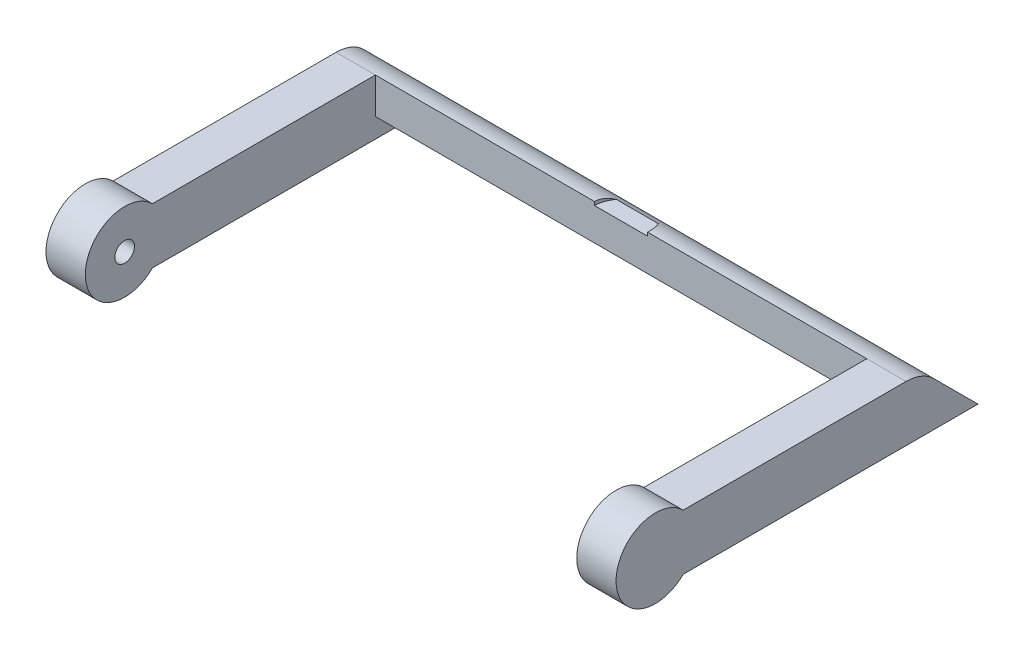
ISO-10303-21;
HEADER;
FILE_DESCRIPTION(('STEP AP214'),'2;1');
FILE_NAME('part.step','',(''),(''),'','','');
FILE_SCHEMA(('AUTOMOTIVE_DESIGN { 1 0 10303 214 1 1 1 1 }'));
ENDSEC;
DATA;
#1=APPLICATION_CONTEXT('core data for automotive mechanical design processes');
#2=APPLICATION_PROTOCOL_DEFINITION('international standard','automotive_design',2000,#1);
#3=PRODUCT_CONTEXT('',#1,'mechanical');
#4=PRODUCT('Part','Part','',(#3));
#5=PRODUCT_RELATED_PRODUCT_CATEGORY('part','',(#4));
#6=PRODUCT_DEFINITION_FORMATION('','',#4);
#7=PRODUCT_DEFINITION_CONTEXT('part definition',#1,'design');
#8=PRODUCT_DEFINITION('design','',#6,#7);
#9=PRODUCT_DEFINITION_SHAPE('','',#8);
#10=(LENGTH_UNIT() NAMED_UNIT(*) SI_UNIT(.MILLI.,.METRE.));
#11=(NAMED_UNIT(*) PLANE_ANGLE_UNIT() SI_UNIT($,.RADIAN.));
#12=(NAMED_UNIT(*) SI_UNIT($,.STERADIAN.) SOLID_ANGLE_UNIT());
#13=UNCERTAINTY_MEASURE_WITH_UNIT(LENGTH_MEASURE(1.E-05),#10,'distance_accuracy_value','');
#14=(GEOMETRIC_REPRESENTATION_CONTEXT(3) GLOBAL_UNCERTAINTY_ASSIGNED_CONTEXT((#13)) GLOBAL_UNIT_ASSIGNED_CONTEXT((#10,
#11,#12)) REPRESENTATION_CONTEXT('',''));
#15=CARTESIAN_POINT('',(0.,0.,0.));
#16=DIRECTION('',(0.,0.,1.));
#17=DIRECTION('',(1.,0.,0.));
#18=AXIS2_PLACEMENT_3D('',#15,#16,#17);
#19=CARTESIAN_POINT('',(29.,1.41421356237309,1.4142135623731));
#20=DIRECTION('',(-1.,0.,0.));
#21=DIRECTION('',(0.,0.,1.));
#22=AXIS2_PLACEMENT_3D('',#19,#20,#21);
#23=CYLINDRICAL_SURFACE('',#22,2.);
#24=DIRECTION('',(-1.,0.,0.));
#25=VECTOR('',#24,1.);
#26=CARTESIAN_POINT('',(29.,0.,0.));
#27=LINE('',#26,#25);
#28=CARTESIAN_POINT('',(2.,0.,0.));
#29=VERTEX_POINT('',#28);
#30=CARTESIAN_POINT('',(0.,0.,0.));
#31=VERTEX_POINT('',#30);
#32=EDGE_CURVE('E261',#29,#31,#27,.T.);
#33=ORIENTED_EDGE('',*,*,#32,.F.);
#34=CARTESIAN_POINT('',(2.,1.41421356237309,1.4142135623731));
#35=DIRECTION('',(-1.,0.,0.));
#36=DIRECTION('',(0.,0.,1.));
#37=AXIS2_PLACEMENT_3D('',#34,#35,#36);
#38=CIRCLE('',#37,2.);
#39=CARTESIAN_POINT('',(2.,2.82842712474618,0.));
#40=VERTEX_POINT('',#39);
#41=EDGE_CURVE('E287',#29,#40,#38,.T.);
#42=ORIENTED_EDGE('',*,*,#41,.T.);
#43=DIRECTION('',(-1.,0.,0.));
#44=VECTOR('',#43,1.);
#45=CARTESIAN_POINT('',(29.,2.82842712474618,0.));
#46=LINE('',#45,#44);
#47=CARTESIAN_POINT('',(0.,2.82842712474618,0.));
#48=VERTEX_POINT('',#47);
#49=EDGE_CURVE('E245',#40,#48,#46,.T.);
#50=ORIENTED_EDGE('',*,*,#49,.T.);
#51=CARTESIAN_POINT('',(0.,1.41421356237309,1.4142135623731));
#52=DIRECTION('',(1.,0.,0.));
#53=DIRECTION('',(0.,0.,-1.));
#54=AXIS2_PLACEMENT_3D('',#51,#52,#53);
#55=CIRCLE('',#54,2.);
#56=EDGE_CURVE('E294',#48,#31,#55,.T.);
#57=ORIENTED_EDGE('',*,*,#56,.T.);
#58=EDGE_LOOP('',(#33,#42,#50,#57));
#59=FACE_BOUND('',#58,.T.);
#60=ADVANCED_FACE('F32',(#59),#23,.T.);
#61=CARTESIAN_POINT('',(29.,2.82842712474617,-11.3431457505076));
#62=DIRECTION('',(0.,-1.,0.));
#63=DIRECTION('',(0.,0.,-1.));
#64=AXIS2_PLACEMENT_3D('',#61,#62,#63);
#65=PLANE('',#64);
#66=ORIENTED_EDGE('',*,*,#49,.F.);
#67=DIRECTION('',(0.,0.,-1.));
#68=VECTOR('',#67,1.);
#69=CARTESIAN_POINT('',(2.,2.82842712474617,-11.3431457505076));
#70=LINE('',#69,#68);
#71=CARTESIAN_POINT('',(2.,2.82842712474616,-11.3431457505076));
#72=VERTEX_POINT('',#71);
#73=EDGE_CURVE('E266',#40,#72,#70,.T.);
#74=ORIENTED_EDGE('',*,*,#73,.T.);
#75=DIRECTION('',(-1.,0.,0.));
#76=VECTOR('',#75,1.);
#77=CARTESIAN_POINT('',(29.,2.82842712474617,-11.3431457505076));
#78=LINE('',#77,#76);
#79=CARTESIAN_POINT('',(0.,2.82842712474617,-11.3431457505076));
#80=VERTEX_POINT('',#79);
#81=EDGE_CURVE('E244',#72,#80,#78,.T.);
#82=ORIENTED_EDGE('',*,*,#81,.T.);
#83=DIRECTION('',(0.,0.,1.));
#84=VECTOR('',#83,1.);
#85=CARTESIAN_POINT('',(0.,2.82842712474617,-11.3431457505076));
#86=LINE('',#85,#84);
#87=EDGE_CURVE('E251',#80,#48,#86,.T.);
#88=ORIENTED_EDGE('',*,*,#87,.T.);
#89=EDGE_LOOP('',(#66,#74,#82,#88));
#90=FACE_BOUND('',#89,.T.);
#91=ADVANCED_FACE('F209',(#90),#65,.F.);
#92=CARTESIAN_POINT('',(29.,2.82842712474618,0.));
#93=VERTEX_POINT('',#92);
#94=CARTESIAN_POINT('',(27.,2.82842712474618,0.));
#95=VERTEX_POINT('',#94);
#96=EDGE_CURVE('E236',#93,#95,#46,.T.);
#97=ORIENTED_EDGE('',*,*,#96,.T.);
#98=CARTESIAN_POINT('',(27.,1.41421356237309,1.4142135623731));
#99=DIRECTION('',(1.,0.,0.));
#100=DIRECTION('',(0.,0.,-1.));
#101=AXIS2_PLACEMENT_3D('',#98,#99,#100);
#102=CIRCLE('',#101,2.);
#103=CARTESIAN_POINT('',(27.,0.,0.));
#104=VERTEX_POINT('',#103);
#105=EDGE_CURVE('E238',#95,#104,#102,.T.);
#106=ORIENTED_EDGE('',*,*,#105,.T.);
#107=CARTESIAN_POINT('',(29.,0.,0.));
#108=VERTEX_POINT('',#107);
#109=EDGE_CURVE('E262',#108,#104,#27,.T.);
#110=ORIENTED_EDGE('',*,*,#109,.F.);
#111=CARTESIAN_POINT('',(29.,1.41421356237309,1.4142135623731));
#112=DIRECTION('',(1.,0.,0.));
#113=DIRECTION('',(0.,0.,-1.));
#114=AXIS2_PLACEMENT_3D('',#111,#112,#113);
#115=CIRCLE('',#114,2.);
#116=EDGE_CURVE('E241',#93,#108,#115,.T.);
#117=ORIENTED_EDGE('',*,*,#116,.F.);
#118=EDGE_LOOP('',(#97,#106,#110,#117));
#119=FACE_BOUND('',#118,.T.);
#120=ADVANCED_FACE('F217',(#119),#23,.T.);
#121=CARTESIAN_POINT('',(29.,0.,0.));
#122=DIRECTION('',(0.,1.,0.));
#123=DIRECTION('',(0.,0.,1.));
#124=AXIS2_PLACEMENT_3D('',#121,#122,#123);
#125=PLANE('',#124);
#126=DIRECTION('',(-1.,0.,0.));
#127=VECTOR('',#126,1.);
#128=CARTESIAN_POINT('',(29.,0.,-12.3431457505076));
#129=LINE('',#128,#127);
#130=CARTESIAN_POINT('',(27.,0.,-12.3431457505076));
#131=VERTEX_POINT('',#130);
#132=CARTESIAN_POINT('',(2.,0.,-12.3431457505076));
#133=VERTEX_POINT('',#132);
#134=EDGE_CURVE('E269',#131,#133,#129,.T.);
#135=ORIENTED_EDGE('',*,*,#134,.T.);
#136=DIRECTION('',(0.,0.,1.));
#137=VECTOR('',#136,1.);
#138=CARTESIAN_POINT('',(2.,0.,0.));
#139=LINE('',#138,#137);
#140=EDGE_CURVE('E285',#133,#29,#139,.T.);
#141=ORIENTED_EDGE('',*,*,#140,.T.);
#142=ORIENTED_EDGE('',*,*,#32,.T.);
#143=DIRECTION('',(0.,0.,-1.));
#144=VECTOR('',#143,1.);
#145=CARTESIAN_POINT('',(0.,0.,0.));
#146=LINE('',#145,#144);
#147=CARTESIAN_POINT('',(0.,0.,-15.));
#148=VERTEX_POINT('',#147);
#149=EDGE_CURVE('E305',#31,#148,#146,.T.);
#150=ORIENTED_EDGE('',*,*,#149,.T.);
#151=DIRECTION('',(-1.,0.,0.));
#152=VECTOR('',#151,1.);
#153=CARTESIAN_POINT('',(29.,0.,-15.));
#154=LINE('',#153,#152);
#155=CARTESIAN_POINT('',(29.,0.,-15.));
#156=VERTEX_POINT('',#155);
#157=EDGE_CURVE('E258',#156,#148,#154,.T.);
#158=ORIENTED_EDGE('',*,*,#157,.F.);
#159=DIRECTION('',(0.,0.,-1.));
#160=VECTOR('',#159,1.);
#161=CARTESIAN_POINT('',(29.,0.,0.));
#162=LINE('',#161,#160);
#163=EDGE_CURVE('E296',#108,#156,#162,.T.);
#164=ORIENTED_EDGE('',*,*,#163,.F.);
#165=ORIENTED_EDGE('',*,*,#109,.T.);
#166=DIRECTION('',(0.,0.,-1.));
#167=VECTOR('',#166,1.);
#168=CARTESIAN_POINT('',(27.,0.,0.));
#169=LINE('',#168,#167);
#170=EDGE_CURVE('E286',#104,#131,#169,.T.);
#171=ORIENTED_EDGE('',*,*,#170,.T.);
#172=EDGE_LOOP('',(#135,#141,#142,#150,#158,#164,#165,#171));
#173=FACE_BOUND('',#172,.T.);
#174=ADVANCED_FACE('F226',(#173),#125,.F.);
#175=CARTESIAN_POINT('',(29.,0.,-15.));
#176=DIRECTION('',(0.,-0.707106781186552,0.707106781186543));
#177=DIRECTION('',(0.,-0.707106781186543,-0.707106781186552));
#178=AXIS2_PLACEMENT_3D('',#175,#176,#177);
#179=PLANE('',#178);
#180=DIRECTION('',(0.,0.707106781186543,0.707106781186552));
#181=VECTOR('',#180,1.);
#182=CARTESIAN_POINT('',(0.,0.,-15.));
#183=LINE('',#182,#181);
#184=CARTESIAN_POINT('',(0.,2.24264068711927,-12.7573593128807));
#185=VERTEX_POINT('',#184);
#186=EDGE_CURVE('E307',#148,#185,#183,.T.);
#187=ORIENTED_EDGE('',*,*,#186,.T.);
#188=DIRECTION('',(-1.,0.,0.));
#189=VECTOR('',#188,1.);
#190=CARTESIAN_POINT('',(29.,2.24264068711927,-12.7573593128807));
#191=LINE('',#190,#189);
#192=CARTESIAN_POINT('',(29.,2.24264068711927,-12.7573593128807));
#193=VERTEX_POINT('',#192);
#194=EDGE_CURVE('E255',#193,#185,#191,.T.);
#195=ORIENTED_EDGE('',*,*,#194,.F.);
#196=DIRECTION('',(0.,0.707106781186543,0.707106781186552));
#197=VECTOR('',#196,1.);
#198=CARTESIAN_POINT('',(29.,0.,-15.));
#199=LINE('',#198,#197);
#200=EDGE_CURVE('E298',#156,#193,#199,.T.);
#201=ORIENTED_EDGE('',*,*,#200,.F.);
#202=ORIENTED_EDGE('',*,*,#157,.T.);
#203=EDGE_LOOP('',(#187,#195,#201,#202));
#204=FACE_BOUND('',#203,.T.);
#205=ADVANCED_FACE('F213',(#204),#179,.F.);
#206=CARTESIAN_POINT('',(29.,0.828427124746175,-11.3431457505076));
#207=DIRECTION('',(-1.,0.,0.));
#208=DIRECTION('',(0.,0.,1.));
#209=AXIS2_PLACEMENT_3D('',#206,#207,#208);
#210=CYLINDRICAL_SURFACE('',#209,2.);
#211=CARTESIAN_POINT('',(13.15,2.82842712474617,-11.3431457505076));
#212=VERTEX_POINT('',#211);
#213=EDGE_CURVE('E247',#212,#72,#78,.T.);
#214=ORIENTED_EDGE('',*,*,#213,.F.);
#215=CARTESIAN_POINT('',(13.15,2.82842712474617,-11.3431457505076));
#216=CARTESIAN_POINT('',(13.1499972628523,2.82843115086963,-11.3770880543687));
#217=CARTESIAN_POINT('',(13.1512811094688,2.82756214173924,-11.411010810345));
#218=CARTESIAN_POINT('',(13.1563821167431,2.82412343152255,-11.4785605405014));
#219=CARTESIAN_POINT('',(13.160197906836,2.82155465054085,-11.5121876647368));
#220=CARTESIAN_POINT('',(13.1753269336155,2.81140455140529,-11.6119095583994));
#221=CARTESIAN_POINT('',(13.1903228686697,2.80137837333245,-11.6772433789643));
#222=CARTESIAN_POINT('',(13.2292885475415,2.77573163759275,-11.8037774567653));
#223=CARTESIAN_POINT('',(13.2532414261273,2.76012159629112,-11.8649852289818));
#224=CARTESIAN_POINT('',(13.3091110056341,2.72454216656214,-11.9822861784586));
#225=CARTESIAN_POINT('',(13.3410276898247,2.70457278729293,-12.0383793664633));
#226=CARTESIAN_POINT('',(13.3852419281068,2.67778826554018,-12.1047692108744));
#227=CARTESIAN_POINT('',(13.3943089063496,2.67233533919805,-12.1178719895626));
#228=CARTESIAN_POINT('',(13.4128482350415,2.66127832629843,-12.143678284202));
#229=CARTESIAN_POINT('',(13.4223197492014,2.65567455967439,-12.156382537834));
#230=CARTESIAN_POINT('',(13.4319982491304,2.65,-12.1689013197528));
#231=B_SPLINE_CURVE_WITH_KNOTS('',3,(#215,#216,#217,#218,#219,#220,#221,#222,#223,#224,#225,
#226,#227,#228,#229,#230),.UNSPECIFIED.,.F.,.F.,(4,2,2,2,2,2,2,4),(0.,0.101754112496537,
0.203453189418262,0.40567303818026,0.607514024351952,0.809354586497716,0.859873403102788,
0.910292409298968),.UNSPECIFIED.);
#232=CARTESIAN_POINT('',(13.4319982491304,2.65,-12.1689013197528));
#233=VERTEX_POINT('',#232);
#234=EDGE_CURVE('E158',#212,#233,#231,.T.);
#235=ORIENTED_EDGE('',*,*,#234,.T.);
#236=DIRECTION('',(-1.,0.,0.));
#237=VECTOR('',#236,1.);
#238=CARTESIAN_POINT('',(29.,2.65,-12.1689013197528));
#239=LINE('',#238,#237);
#240=CARTESIAN_POINT('',(15.5680017508696,2.65,-12.1689013197528));
#241=VERTEX_POINT('',#240);
#242=EDGE_CURVE('E147',#241,#233,#239,.T.);
#243=ORIENTED_EDGE('',*,*,#242,.F.);
#244=CARTESIAN_POINT('',(15.5680017508696,2.65,-12.1689013197528));
#245=CARTESIAN_POINT('',(15.5887352963508,2.66215851737395,-12.1420788128462));
#246=CARTESIAN_POINT('',(15.6085276645336,2.67399272077239,-12.1143968088087));
#247=CARTESIAN_POINT('',(15.646121771746,2.69681415053488,-12.0573427487001));
#248=CARTESIAN_POINT('',(15.6639216735314,2.70780059232944,-12.0279691700159));
#249=CARTESIAN_POINT('',(15.7142702053866,2.73925410284327,-11.9371515069886));
#250=CARTESIAN_POINT('',(15.7435732665982,2.75809886334726,-11.8732597678558));
#251=CARTESIAN_POINT('',(15.78977940278,2.78821191698667,-11.7469327299548));
#252=CARTESIAN_POINT('',(15.8076180614918,2.80004277550221,-11.6849713365254));
#253=CARTESIAN_POINT('',(15.8342645768329,2.81781436427919,-11.5585062604591));
#254=CARTESIAN_POINT('',(15.8431112424635,2.82378040311615,-11.4940147615473));
#255=CARTESIAN_POINT('',(15.8481703982559,2.82719269203904,-11.4148720441307));
#256=CARTESIAN_POINT('',(15.848856216873,2.82765530262149,-11.400539030176));
#257=CARTESIAN_POINT('',(15.84977056135,2.82827215053383,-11.3718542260531));
#258=CARTESIAN_POINT('',(15.8499991650685,2.82842644036731,-11.3575024394982));
#259=CARTESIAN_POINT('',(15.85,2.82842712474617,-11.3431457505076));
#260=B_SPLINE_CURVE_WITH_KNOTS('',3,(#244,#245,#246,#247,#248,#249,#250,#251,#252,#253,#254,
#255,#256,#257,#258,#259),.UNSPECIFIED.,.F.,.F.,(4,2,2,2,2,2,2,4),(0.,0.107996761891491,
0.216092300738554,0.433283261689141,0.629130325694788,0.824128487506165,0.86719344574214,
0.910251069869562),.UNSPECIFIED.);
#261=CARTESIAN_POINT('',(15.85,2.82842712474617,-11.3431457505076));
#262=VERTEX_POINT('',#261);
#263=EDGE_CURVE('E133',#241,#262,#260,.T.);
#264=ORIENTED_EDGE('',*,*,#263,.T.);
#265=CARTESIAN_POINT('',(27.,2.82842712474617,-11.3431457505076));
#266=VERTEX_POINT('',#265);
#267=EDGE_CURVE('E146',#266,#262,#78,.T.);
#268=ORIENTED_EDGE('',*,*,#267,.F.);
#269=CARTESIAN_POINT('',(29.,2.82842712474617,-11.3431457505076));
#270=VERTEX_POINT('',#269);
#271=EDGE_CURVE('E253',#270,#266,#78,.T.);
#272=ORIENTED_EDGE('',*,*,#271,.F.);
#273=CARTESIAN_POINT('',(29.,0.828427124746175,-11.3431457505076));
#274=DIRECTION('',(1.,0.,0.));
#275=DIRECTION('',(0.,0.,-1.));
#276=AXIS2_PLACEMENT_3D('',#273,#274,#275);
#277=CIRCLE('',#276,2.);
#278=EDGE_CURVE('E300',#193,#270,#277,.T.);
#279=ORIENTED_EDGE('',*,*,#278,.F.);
#280=ORIENTED_EDGE('',*,*,#194,.T.);
#281=CARTESIAN_POINT('',(0.,0.828427124746175,-11.3431457505076));
#282=DIRECTION('',(1.,0.,0.));
#283=DIRECTION('',(0.,0.,-1.));
#284=AXIS2_PLACEMENT_3D('',#281,#282,#283);
#285=CIRCLE('',#284,2.);
#286=EDGE_CURVE('E308',#185,#80,#285,.T.);
#287=ORIENTED_EDGE('',*,*,#286,.T.);
#288=ORIENTED_EDGE('',*,*,#81,.F.);
#289=EDGE_LOOP('',(#214,#235,#243,#264,#268,#272,#279,#280,#287,#288));
#290=FACE_BOUND('',#289,.T.);
#291=ADVANCED_FACE('F163',(#290),#210,.T.);
#292=ORIENTED_EDGE('',*,*,#271,.T.);
#293=DIRECTION('',(0.,0.,1.));
#294=VECTOR('',#293,1.);
#295=CARTESIAN_POINT('',(27.,2.82842712474617,-11.3431457505076));
#296=LINE('',#295,#294);
#297=EDGE_CURVE('E264',#266,#95,#296,.T.);
#298=ORIENTED_EDGE('',*,*,#297,.T.);
#299=ORIENTED_EDGE('',*,*,#96,.F.);
#300=DIRECTION('',(0.,0.,1.));
#301=VECTOR('',#300,1.);
#302=CARTESIAN_POINT('',(29.,2.82842712474617,-11.3431457505076));
#303=LINE('',#302,#301);
#304=EDGE_CURVE('E249',#270,#93,#303,.T.);
#305=ORIENTED_EDGE('',*,*,#304,.F.);
#306=EDGE_LOOP('',(#292,#298,#299,#305));
#307=FACE_BOUND('',#306,.T.);
#308=ADVANCED_FACE('F203',(#307),#65,.F.);
#309=CARTESIAN_POINT('',(29.,1.41421356237309,1.4142135623731));
#310=DIRECTION('',(1.,0.,0.));
#311=DIRECTION('',(0.,0.,-1.));
#312=AXIS2_PLACEMENT_3D('',#309,#310,#311);
#313=PLANE('',#312);
#314=ORIENTED_EDGE('',*,*,#116,.T.);
#315=ORIENTED_EDGE('',*,*,#163,.T.);
#316=ORIENTED_EDGE('',*,*,#200,.T.);
#317=ORIENTED_EDGE('',*,*,#278,.T.);
#318=ORIENTED_EDGE('',*,*,#304,.T.);
#319=EDGE_LOOP('',(#314,#315,#316,#317,#318));
#320=FACE_BOUND('',#319,.T.);
#321=ADVANCED_FACE('F200',(#320),#313,.T.);
#322=CARTESIAN_POINT('',(0.,1.41421356237309,1.4142135623731));
#323=DIRECTION('',(1.,0.,0.));
#324=DIRECTION('',(0.,0.,-1.));
#325=AXIS2_PLACEMENT_3D('',#322,#323,#324);
#326=PLANE('',#325);
#327=ORIENTED_EDGE('',*,*,#56,.F.);
#328=ORIENTED_EDGE('',*,*,#87,.F.);
#329=ORIENTED_EDGE('',*,*,#286,.F.);
#330=ORIENTED_EDGE('',*,*,#186,.F.);
#331=ORIENTED_EDGE('',*,*,#149,.F.);
#332=EDGE_LOOP('',(#327,#328,#329,#330,#331));
#333=FACE_BOUND('',#332,.T.);
#334=ADVANCED_FACE('F192',(#333),#326,.F.);
#335=CARTESIAN_POINT('',(2.,-11.6715728752538,0.));
#336=DIRECTION('',(-1.,0.,0.));
#337=DIRECTION('',(0.,0.,1.));
#338=AXIS2_PLACEMENT_3D('',#335,#336,#337);
#339=PLANE('',#338);
#340=CARTESIAN_POINT('',(2.,1.41421356237309,1.4142135623731));
#341=DIRECTION('',(1.,0.,0.));
#342=DIRECTION('',(0.,0.,-1.));
#343=AXIS2_PLACEMENT_3D('',#340,#341,#342);
#344=CIRCLE('',#343,0.5);
#345=CARTESIAN_POINT('',(2.,1.41421356237309,0.914213562373097));
#346=VERTEX_POINT('',#345);
#347=EDGE_CURVE('E320',#346,#346,#344,.T.);
#348=ORIENTED_EDGE('',*,*,#347,.F.);
#349=EDGE_LOOP('',(#348));
#350=FACE_BOUND('',#349,.T.);
#351=ORIENTED_EDGE('',*,*,#140,.F.);
#352=DIRECTION('',(0.,-0.707106781186546,-0.707106781186549));
#353=VECTOR('',#352,1.);
#354=CARTESIAN_POINT('',(2.,0.335786437626925,-12.0073593128807));
#355=LINE('',#354,#353);
#356=CARTESIAN_POINT('',(2.,0.999999999999997,-11.3431457505076));
#357=VERTEX_POINT('',#356);
#358=EDGE_CURVE('E40',#133,#357,#355,.F.);
#359=ORIENTED_EDGE('',*,*,#358,.T.);
#360=DIRECTION('',(0.,1.,0.));
#361=VECTOR('',#360,1.);
#362=CARTESIAN_POINT('',(2.,-11.6715728752538,-11.3431457505076));
#363=LINE('',#362,#361);
#364=EDGE_CURVE('E277',#357,#72,#363,.T.);
#365=ORIENTED_EDGE('',*,*,#364,.T.);
#366=ORIENTED_EDGE('',*,*,#73,.F.);
#367=ORIENTED_EDGE('',*,*,#41,.F.);
#368=EDGE_LOOP('',(#351,#359,#365,#366,#367));
#369=FACE_BOUND('',#368,.T.);
#370=ADVANCED_FACE('F189',(#350,#369),#339,.F.);
#371=CARTESIAN_POINT('',(2.,-11.6715728752538,-11.3431457505076));
#372=DIRECTION('',(0.,0.,-1.));
#373=DIRECTION('',(0.,1.,0.));
#374=AXIS2_PLACEMENT_3D('',#371,#372,#373);
#375=PLANE('',#374);
#376=DIRECTION('',(1.,0.,0.));
#377=VECTOR('',#376,1.);
#378=CARTESIAN_POINT('',(13.15,2.65,-11.3431457505076));
#379=LINE('',#378,#377);
#380=CARTESIAN_POINT('',(13.15,2.65,-11.3431457505076));
#381=VERTEX_POINT('',#380);
#382=CARTESIAN_POINT('',(15.85,2.65,-11.3431457505076));
#383=VERTEX_POINT('',#382);
#384=EDGE_CURVE('E136',#381,#383,#379,.T.);
#385=ORIENTED_EDGE('',*,*,#384,.F.);
#386=DIRECTION('',(0.,1.,0.));
#387=VECTOR('',#386,1.);
#388=CARTESIAN_POINT('',(13.15,2.65,-11.3431457505076));
#389=LINE('',#388,#387);
#390=EDGE_CURVE('E47',#381,#212,#389,.T.);
#391=ORIENTED_EDGE('',*,*,#390,.T.);
#392=ORIENTED_EDGE('',*,*,#213,.T.);
#393=ORIENTED_EDGE('',*,*,#364,.F.);
#394=DIRECTION('',(1.,0.,0.));
#395=VECTOR('',#394,1.);
#396=CARTESIAN_POINT('',(2.,1.,-11.3431457505076));
#397=LINE('',#396,#395);
#398=CARTESIAN_POINT('',(27.,0.999999999999997,-11.3431457505076));
#399=VERTEX_POINT('',#398);
#400=EDGE_CURVE('E272',#357,#399,#397,.T.);
#401=ORIENTED_EDGE('',*,*,#400,.T.);
#402=DIRECTION('',(0.,1.,0.));
#403=VECTOR('',#402,1.);
#404=CARTESIAN_POINT('',(27.,-11.6715728752538,-11.3431457505076));
#405=LINE('',#404,#403);
#406=EDGE_CURVE('E275',#399,#266,#405,.T.);
#407=ORIENTED_EDGE('',*,*,#406,.T.);
#408=ORIENTED_EDGE('',*,*,#267,.T.);
#409=DIRECTION('',(0.,1.,0.));
#410=VECTOR('',#409,1.);
#411=CARTESIAN_POINT('',(15.85,2.65,-11.3431457505076));
#412=LINE('',#411,#410);
#413=EDGE_CURVE('E131',#383,#262,#412,.T.);
#414=ORIENTED_EDGE('',*,*,#413,.F.);
#415=EDGE_LOOP('',(#385,#391,#392,#393,#401,#407,#408,#414));
#416=FACE_BOUND('',#415,.T.);
#417=ADVANCED_FACE('F144',(#416),#375,.F.);
#418=CARTESIAN_POINT('',(27.,-11.6715728752538,-11.3431457505076));
#419=DIRECTION('',(1.,0.,0.));
#420=DIRECTION('',(0.,0.,-1.));
#421=AXIS2_PLACEMENT_3D('',#418,#419,#420);
#422=PLANE('',#421);
#423=CARTESIAN_POINT('',(27.,1.41421356237309,1.4142135623731));
#424=DIRECTION('',(-1.,0.,0.));
#425=DIRECTION('',(0.,0.,1.));
#426=AXIS2_PLACEMENT_3D('',#423,#424,#425);
#427=CIRCLE('',#426,0.5);
#428=CARTESIAN_POINT('',(27.,1.41421356237309,1.9142135623731));
#429=VERTEX_POINT('',#428);
#430=EDGE_CURVE('E327',#429,#429,#427,.T.);
#431=ORIENTED_EDGE('',*,*,#430,.F.);
#432=EDGE_LOOP('',(#431));
#433=FACE_BOUND('',#432,.T.);
#434=ORIENTED_EDGE('',*,*,#105,.F.);
#435=ORIENTED_EDGE('',*,*,#297,.F.);
#436=ORIENTED_EDGE('',*,*,#406,.F.);
#437=DIRECTION('',(0.,0.707106781186546,0.707106781186549));
#438=VECTOR('',#437,1.);
#439=CARTESIAN_POINT('',(27.,-5.33578643762689,-17.6789321881345));
#440=LINE('',#439,#438);
#441=EDGE_CURVE('E11',#399,#131,#440,.F.);
#442=ORIENTED_EDGE('',*,*,#441,.T.);
#443=ORIENTED_EDGE('',*,*,#170,.F.);
#444=EDGE_LOOP('',(#434,#435,#436,#442,#443));
#445=FACE_BOUND('',#444,.T.);
#446=ADVANCED_FACE('F196',(#433,#445),#422,.F.);
#447=CARTESIAN_POINT('',(29.,0.,-12.3431457505076));
#448=DIRECTION('',(0.,0.707106781186549,-0.707106781186546));
#449=DIRECTION('',(-1.,0.,0.));
#450=AXIS2_PLACEMENT_3D('',#447,#448,#449);
#451=PLANE('',#450);
#452=ORIENTED_EDGE('',*,*,#441,.F.);
#453=ORIENTED_EDGE('',*,*,#400,.F.);
#454=ORIENTED_EDGE('',*,*,#358,.F.);
#455=ORIENTED_EDGE('',*,*,#134,.F.);
#456=EDGE_LOOP('',(#452,#453,#454,#455));
#457=FACE_BOUND('',#456,.T.);
#458=ADVANCED_FACE('F34',(#457),#451,.F.);
#459=CARTESIAN_POINT('',(28.,1.41421356237309,1.4142135623731));
#460=DIRECTION('',(-1.,0.,0.));
#461=DIRECTION('',(0.,0.,1.));
#462=AXIS2_PLACEMENT_3D('',#459,#460,#461);
#463=CYLINDRICAL_SURFACE('',#462,0.5);
#464=CARTESIAN_POINT('',(28.,1.41421356237309,1.4142135623731));
#465=DIRECTION('',(-1.,0.,0.));
#466=DIRECTION('',(0.,0.,1.));
#467=AXIS2_PLACEMENT_3D('',#464,#465,#466);
#468=CIRCLE('',#467,0.5);
#469=CARTESIAN_POINT('',(28.,1.41421356237309,1.9142135623731));
#470=VERTEX_POINT('',#469);
#471=EDGE_CURVE('E282',#470,#470,#468,.T.);
#472=ORIENTED_EDGE('',*,*,#471,.F.);
#473=EDGE_LOOP('',(#472));
#474=FACE_BOUND('',#473,.T.);
#475=ORIENTED_EDGE('',*,*,#430,.T.);
#476=EDGE_LOOP('',(#475));
#477=FACE_BOUND('',#476,.T.);
#478=ADVANCED_FACE('F184',(#474,#477),#463,.F.);
#479=CARTESIAN_POINT('',(28.,1.41421356237309,1.4142135623731));
#480=DIRECTION('',(-1.,0.,0.));
#481=DIRECTION('',(0.,0.,1.));
#482=AXIS2_PLACEMENT_3D('',#479,#480,#481);
#483=PLANE('',#482);
#484=ORIENTED_EDGE('',*,*,#471,.T.);
#485=EDGE_LOOP('',(#484));
#486=FACE_BOUND('',#485,.T.);
#487=ADVANCED_FACE('F180',(#486),#483,.T.);
#488=CARTESIAN_POINT('',(1.,1.41421356237309,1.4142135623731));
#489=DIRECTION('',(1.,0.,0.));
#490=DIRECTION('',(0.,0.,-1.));
#491=AXIS2_PLACEMENT_3D('',#488,#489,#490);
#492=CYLINDRICAL_SURFACE('',#491,0.5);
#493=CARTESIAN_POINT('',(1.,1.41421356237309,1.4142135623731));
#494=DIRECTION('',(1.,0.,0.));
#495=DIRECTION('',(0.,0.,-1.));
#496=AXIS2_PLACEMENT_3D('',#493,#494,#495);
#497=CIRCLE('',#496,0.5);
#498=CARTESIAN_POINT('',(1.,1.41421356237309,0.914213562373097));
#499=VERTEX_POINT('',#498);
#500=EDGE_CURVE('E322',#499,#499,#497,.T.);
#501=ORIENTED_EDGE('',*,*,#500,.F.);
#502=EDGE_LOOP('',(#501));
#503=FACE_BOUND('',#502,.T.);
#504=ORIENTED_EDGE('',*,*,#347,.T.);
#505=EDGE_LOOP('',(#504));
#506=FACE_BOUND('',#505,.T.);
#507=ADVANCED_FACE('F176',(#503,#506),#492,.F.);
#508=CARTESIAN_POINT('',(1.,1.41421356237309,1.4142135623731));
#509=DIRECTION('',(1.,0.,0.));
#510=DIRECTION('',(0.,0.,-1.));
#511=AXIS2_PLACEMENT_3D('',#508,#509,#510);
#512=PLANE('',#511);
#513=ORIENTED_EDGE('',*,*,#500,.T.);
#514=EDGE_LOOP('',(#513));
#515=FACE_BOUND('',#514,.T.);
#516=ADVANCED_FACE('F172',(#515),#512,.T.);
#517=CARTESIAN_POINT('',(14.5,2.65,-11.3431457505076));
#518=DIRECTION('',(0.,1.,0.));
#519=DIRECTION('',(0.,0.,1.));
#520=AXIS2_PLACEMENT_3D('',#517,#518,#519);
#521=CYLINDRICAL_SURFACE('',#520,1.35);
#522=ORIENTED_EDGE('',*,*,#390,.F.);
#523=CARTESIAN_POINT('',(14.5,2.65,-11.3431457505076));
#524=DIRECTION('',(0.,1.,0.));
#525=DIRECTION('',(0.,0.,1.));
#526=AXIS2_PLACEMENT_3D('',#523,#524,#525);
#527=CIRCLE('',#526,1.35);
#528=EDGE_CURVE('E137',#233,#381,#527,.T.);
#529=ORIENTED_EDGE('',*,*,#528,.F.);
#530=ORIENTED_EDGE('',*,*,#234,.F.);
#531=EDGE_LOOP('',(#522,#529,#530));
#532=FACE_BOUND('',#531,.T.);
#533=ADVANCED_FACE('F167',(#532),#521,.F.);
#534=EDGE_CURVE('E127',#383,#241,#527,.T.);
#535=ORIENTED_EDGE('',*,*,#534,.F.);
#536=ORIENTED_EDGE('',*,*,#413,.T.);
#537=ORIENTED_EDGE('',*,*,#263,.F.);
#538=EDGE_LOOP('',(#535,#536,#537));
#539=FACE_BOUND('',#538,.T.);
#540=ADVANCED_FACE('F129',(#539),#521,.F.);
#541=CARTESIAN_POINT('',(14.5,2.65,-11.3431457505076));
#542=DIRECTION('',(0.,1.,0.));
#543=DIRECTION('',(0.,0.,1.));
#544=AXIS2_PLACEMENT_3D('',#541,#542,#543);
#545=PLANE('',#544);
#546=ORIENTED_EDGE('',*,*,#242,.T.);
#547=ORIENTED_EDGE('',*,*,#528,.T.);
#548=ORIENTED_EDGE('',*,*,#384,.T.);
#549=ORIENTED_EDGE('',*,*,#534,.T.);
#550=EDGE_LOOP('',(#546,#547,#548,#549));
#551=FACE_BOUND('',#550,.T.);
#552=ADVANCED_FACE('F140',(#551),#545,.T.);
#553=CLOSED_SHELL('',(#60,#91,#120,#174,#205,#291,#308,#321,#334,#370,#417,#446,#458,#478,#487,
#507,#516,#533,#540,#552));
#554=MANIFOLD_SOLID_BREP('B2',#553);
#555=ADVANCED_BREP_SHAPE_REPRESENTATION('',(#18,#554),#14);
#556=SHAPE_DEFINITION_REPRESENTATION(#9,#555);
ENDSEC;
END-ISO-10303-21;
